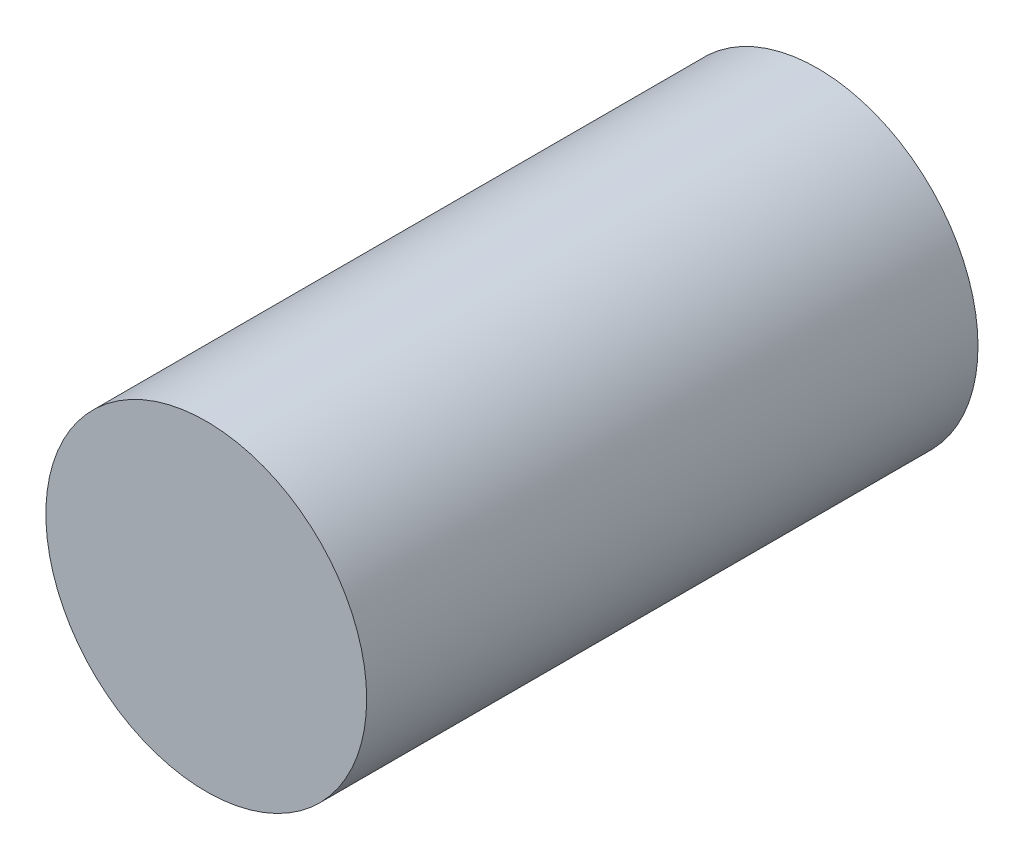
ISO-10303-21;
HEADER;
FILE_DESCRIPTION(('STEP AP214'),'2;1');
FILE_NAME('part.step','',(''),(''),'','','');
FILE_SCHEMA(('AUTOMOTIVE_DESIGN { 1 0 10303 214 1 1 1 1 }'));
ENDSEC;
DATA;
#1=APPLICATION_CONTEXT('core data for automotive mechanical design processes');
#2=APPLICATION_PROTOCOL_DEFINITION('international standard','automotive_design',2000,#1);
#3=PRODUCT_CONTEXT('',#1,'mechanical');
#4=PRODUCT('Part','Part','',(#3));
#5=PRODUCT_RELATED_PRODUCT_CATEGORY('part','',(#4));
#6=PRODUCT_DEFINITION_FORMATION('','',#4);
#7=PRODUCT_DEFINITION_CONTEXT('part definition',#1,'design');
#8=PRODUCT_DEFINITION('design','',#6,#7);
#9=PRODUCT_DEFINITION_SHAPE('','',#8);
#10=(LENGTH_UNIT() NAMED_UNIT(*) SI_UNIT(.MILLI.,.METRE.));
#11=(NAMED_UNIT(*) PLANE_ANGLE_UNIT() SI_UNIT($,.RADIAN.));
#12=(NAMED_UNIT(*) SI_UNIT($,.STERADIAN.) SOLID_ANGLE_UNIT());
#13=UNCERTAINTY_MEASURE_WITH_UNIT(LENGTH_MEASURE(1.E-05),#10,'distance_accuracy_value','');
#14=(GEOMETRIC_REPRESENTATION_CONTEXT(3) GLOBAL_UNCERTAINTY_ASSIGNED_CONTEXT((#13)) GLOBAL_UNIT_ASSIGNED_CONTEXT((#10,
#11,#12)) REPRESENTATION_CONTEXT('',''));
#15=CARTESIAN_POINT('',(0.,0.,0.));
#16=DIRECTION('',(0.,0.,1.));
#17=DIRECTION('',(1.,0.,0.));
#18=AXIS2_PLACEMENT_3D('',#15,#16,#17);
#19=CARTESIAN_POINT('',(0.,0.,0.));
#20=DIRECTION('',(0.,0.,-1.));
#21=DIRECTION('',(-1.,0.,0.));
#22=AXIS2_PLACEMENT_3D('',#19,#20,#21);
#23=PLANE('',#22);
#24=CARTESIAN_POINT('',(0.,0.,0.));
#25=DIRECTION('',(0.,0.,1.));
#26=DIRECTION('',(1.,0.,0.));
#27=AXIS2_PLACEMENT_3D('',#24,#25,#26);
#28=CIRCLE('',#27,22.5);
#29=CARTESIAN_POINT('',(22.5,0.,0.));
#30=VERTEX_POINT('',#29);
#31=EDGE_CURVE('E10',#30,#30,#28,.T.);
#32=ORIENTED_EDGE('',*,*,#31,.T.);
#33=EDGE_LOOP('',(#32));
#34=FACE_BOUND('',#33,.T.);
#35=ADVANCED_FACE('F31',(#34),#23,.F.);
#36=CARTESIAN_POINT('',(0.,0.,0.));
#37=DIRECTION('',(0.,0.,1.));
#38=DIRECTION('',(1.,0.,0.));
#39=AXIS2_PLACEMENT_3D('',#36,#37,#38);
#40=CYLINDRICAL_SURFACE('',#39,22.5);
#41=ORIENTED_EDGE('',*,*,#31,.F.);
#42=EDGE_LOOP('',(#41));
#43=FACE_BOUND('',#42,.T.);
#44=CARTESIAN_POINT('',(0.,0.,-85.75));
#45=DIRECTION('',(0.,0.,1.));
#46=DIRECTION('',(1.,0.,0.));
#47=AXIS2_PLACEMENT_3D('',#44,#45,#46);
#48=CIRCLE('',#47,22.5);
#49=CARTESIAN_POINT('',(22.5,0.,-85.75));
#50=VERTEX_POINT('',#49);
#51=EDGE_CURVE('E37',#50,#50,#48,.T.);
#52=ORIENTED_EDGE('',*,*,#51,.T.);
#53=EDGE_LOOP('',(#52));
#54=FACE_BOUND('',#53,.T.);
#55=ADVANCED_FACE('F43',(#43,#54),#40,.T.);
#56=CARTESIAN_POINT('',(0.,0.,-85.75));
#57=DIRECTION('',(0.,0.,1.));
#58=DIRECTION('',(1.,0.,0.));
#59=AXIS2_PLACEMENT_3D('',#56,#57,#58);
#60=PLANE('',#59);
#61=ORIENTED_EDGE('',*,*,#51,.F.);
#62=EDGE_LOOP('',(#61));
#63=FACE_BOUND('',#62,.T.);
#64=ADVANCED_FACE('F45',(#63),#60,.F.);
#65=CLOSED_SHELL('',(#35,#55,#64));
#66=MANIFOLD_SOLID_BREP('B2',#65);
#67=ADVANCED_BREP_SHAPE_REPRESENTATION('',(#18,#66),#14);
#68=SHAPE_DEFINITION_REPRESENTATION(#9,#67);
ENDSEC;
END-ISO-10303-21;
